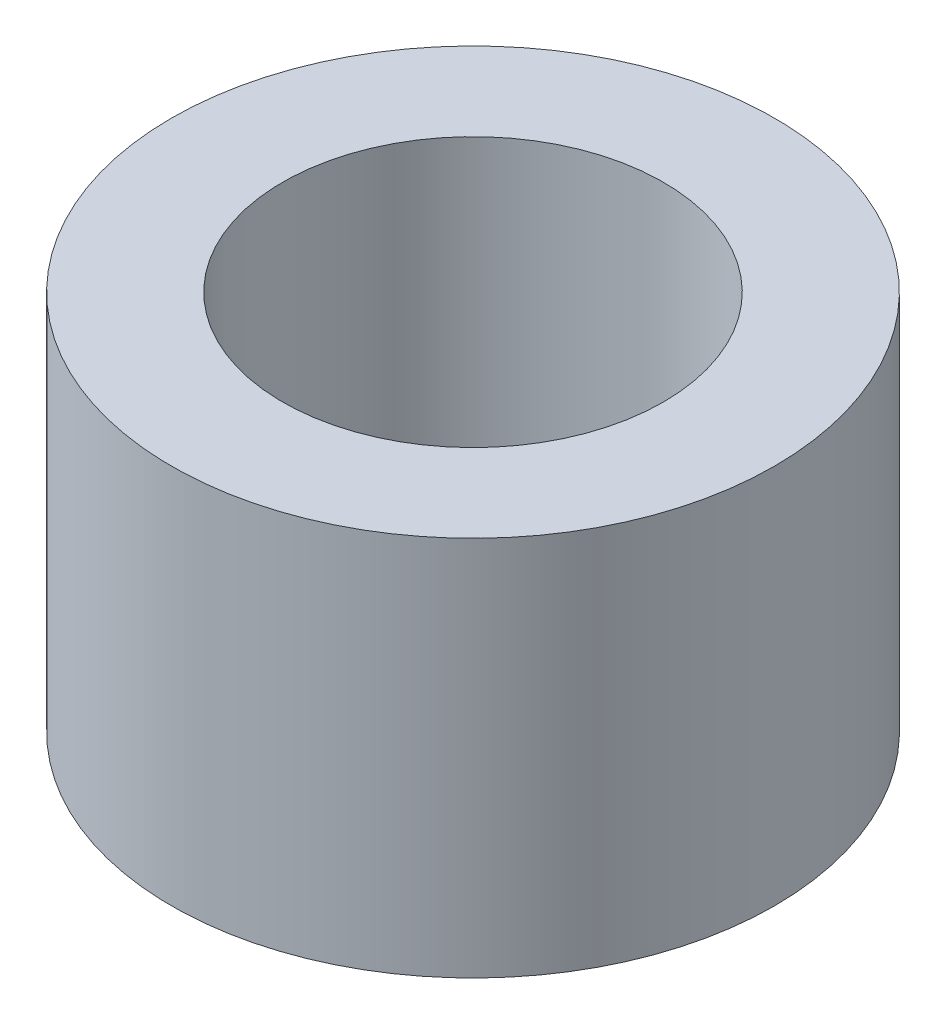
ISO-10303-21;
HEADER;
FILE_DESCRIPTION(('STEP AP214'),'2;1');
FILE_NAME('part.step','',(''),(''),'','','');
FILE_SCHEMA(('AUTOMOTIVE_DESIGN { 1 0 10303 214 1 1 1 1 }'));
ENDSEC;
DATA;
#1=APPLICATION_CONTEXT('core data for automotive mechanical design processes');
#2=APPLICATION_PROTOCOL_DEFINITION('international standard','automotive_design',2000,#1);
#3=PRODUCT_CONTEXT('',#1,'mechanical');
#4=PRODUCT('Part','Part','',(#3));
#5=PRODUCT_RELATED_PRODUCT_CATEGORY('part','',(#4));
#6=PRODUCT_DEFINITION_FORMATION('','',#4);
#7=PRODUCT_DEFINITION_CONTEXT('part definition',#1,'design');
#8=PRODUCT_DEFINITION('design','',#6,#7);
#9=PRODUCT_DEFINITION_SHAPE('','',#8);
#10=(LENGTH_UNIT() NAMED_UNIT(*) SI_UNIT(.MILLI.,.METRE.));
#11=(NAMED_UNIT(*) PLANE_ANGLE_UNIT() SI_UNIT($,.RADIAN.));
#12=(NAMED_UNIT(*) SI_UNIT($,.STERADIAN.) SOLID_ANGLE_UNIT());
#13=UNCERTAINTY_MEASURE_WITH_UNIT(LENGTH_MEASURE(1.E-05),#10,'distance_accuracy_value','');
#14=(GEOMETRIC_REPRESENTATION_CONTEXT(3) GLOBAL_UNCERTAINTY_ASSIGNED_CONTEXT((#13)) GLOBAL_UNIT_ASSIGNED_CONTEXT((#10,
#11,#12)) REPRESENTATION_CONTEXT('',''));
#15=CARTESIAN_POINT('',(0.,0.,0.));
#16=DIRECTION('',(0.,0.,1.));
#17=DIRECTION('',(1.,0.,0.));
#18=AXIS2_PLACEMENT_3D('',#15,#16,#17);
#19=CARTESIAN_POINT('',(0.,10.4,0.));
#20=DIRECTION('',(0.,1.,0.));
#21=DIRECTION('',(1.,0.,0.));
#22=AXIS2_PLACEMENT_3D('',#19,#20,#21);
#23=PLANE('',#22);
#24=CARTESIAN_POINT('',(0.,10.4,0.));
#25=DIRECTION('',(0.,1.,0.));
#26=DIRECTION('',(-1.,0.,0.));
#27=AXIS2_PLACEMENT_3D('',#24,#25,#26);
#28=CIRCLE('',#27,3.);
#29=CARTESIAN_POINT('',(3.,10.4,0.));
#30=VERTEX_POINT('',#29);
#31=EDGE_CURVE('E20',#30,#30,#28,.T.);
#32=ORIENTED_EDGE('',*,*,#31,.T.);
#33=EDGE_LOOP('',(#32));
#34=FACE_BOUND('',#33,.T.);
#35=CARTESIAN_POINT('',(0.,10.4,0.));
#36=DIRECTION('',(0.,-1.,0.));
#37=DIRECTION('',(-1.,0.,0.));
#38=AXIS2_PLACEMENT_3D('',#35,#36,#37);
#39=CIRCLE('',#38,4.75);
#40=CARTESIAN_POINT('',(4.75,10.4,0.));
#41=VERTEX_POINT('',#40);
#42=EDGE_CURVE('E73',#41,#41,#39,.T.);
#43=ORIENTED_EDGE('',*,*,#42,.T.);
#44=EDGE_LOOP('',(#43));
#45=FACE_BOUND('',#44,.T.);
#46=ADVANCED_FACE('F16',(#34,#45),#23,.F.);
#47=CARTESIAN_POINT('',(0.,16.4,0.));
#48=DIRECTION('',(0.,1.,0.));
#49=DIRECTION('',(1.,0.,0.));
#50=AXIS2_PLACEMENT_3D('',#47,#48,#49);
#51=PLANE('',#50);
#52=CARTESIAN_POINT('',(0.,16.4,0.));
#53=DIRECTION('',(0.,-1.,0.));
#54=DIRECTION('',(-1.,0.,0.));
#55=AXIS2_PLACEMENT_3D('',#52,#53,#54);
#56=CIRCLE('',#55,3.);
#57=CARTESIAN_POINT('',(3.,16.4,0.));
#58=VERTEX_POINT('',#57);
#59=EDGE_CURVE('E53',#58,#58,#56,.T.);
#60=ORIENTED_EDGE('',*,*,#59,.T.);
#61=EDGE_LOOP('',(#60));
#62=FACE_BOUND('',#61,.T.);
#63=CARTESIAN_POINT('',(0.,16.4,0.));
#64=DIRECTION('',(0.,1.,0.));
#65=DIRECTION('',(-1.,0.,0.));
#66=AXIS2_PLACEMENT_3D('',#63,#64,#65);
#67=CIRCLE('',#66,4.75);
#68=CARTESIAN_POINT('',(4.75,16.4,0.));
#69=VERTEX_POINT('',#68);
#70=EDGE_CURVE('E11',#69,#69,#67,.T.);
#71=ORIENTED_EDGE('',*,*,#70,.T.);
#72=EDGE_LOOP('',(#71));
#73=FACE_BOUND('',#72,.T.);
#74=ADVANCED_FACE('F18',(#62,#73),#51,.T.);
#75=CARTESIAN_POINT('',(0.,16.4,0.));
#76=DIRECTION('',(0.,-1.,0.));
#77=DIRECTION('',(-1.,0.,0.));
#78=AXIS2_PLACEMENT_3D('',#75,#76,#77);
#79=CYLINDRICAL_SURFACE('',#78,4.75);
#80=ORIENTED_EDGE('',*,*,#42,.F.);
#81=DIRECTION('',(0.,1.,0.));
#82=VECTOR('',#81,1.);
#83=CARTESIAN_POINT('',(4.75,16.4,0.));
#84=LINE('',#83,#82);
#85=EDGE_CURVE('E27',#41,#69,#84,.T.);
#86=ORIENTED_EDGE('',*,*,#85,.T.);
#87=ORIENTED_EDGE('',*,*,#70,.F.);
#88=ORIENTED_EDGE('',*,*,#85,.F.);
#89=EDGE_LOOP('',(#80,#86,#87,#88));
#90=FACE_BOUND('',#89,.T.);
#91=ADVANCED_FACE('F94',(#90),#79,.T.);
#92=CARTESIAN_POINT('',(0.,16.4,0.));
#93=DIRECTION('',(0.,-1.,0.));
#94=DIRECTION('',(-1.,0.,0.));
#95=AXIS2_PLACEMENT_3D('',#92,#93,#94);
#96=CYLINDRICAL_SURFACE('',#95,3.);
#97=ORIENTED_EDGE('',*,*,#31,.F.);
#98=DIRECTION('',(0.,1.,0.));
#99=VECTOR('',#98,1.);
#100=CARTESIAN_POINT('',(3.,16.4,0.));
#101=LINE('',#100,#99);
#102=EDGE_CURVE('E50',#30,#58,#101,.T.);
#103=ORIENTED_EDGE('',*,*,#102,.T.);
#104=ORIENTED_EDGE('',*,*,#59,.F.);
#105=ORIENTED_EDGE('',*,*,#102,.F.);
#106=EDGE_LOOP('',(#97,#103,#104,#105));
#107=FACE_BOUND('',#106,.T.);
#108=ADVANCED_FACE('F52',(#107),#96,.F.);
#109=CLOSED_SHELL('',(#46,#74,#91,#108));
#110=MANIFOLD_SOLID_BREP('B1',#109);
#111=ADVANCED_BREP_SHAPE_REPRESENTATION('',(#18,#110),#14);
#112=SHAPE_DEFINITION_REPRESENTATION(#9,#111);
ENDSEC;
END-ISO-10303-21;
